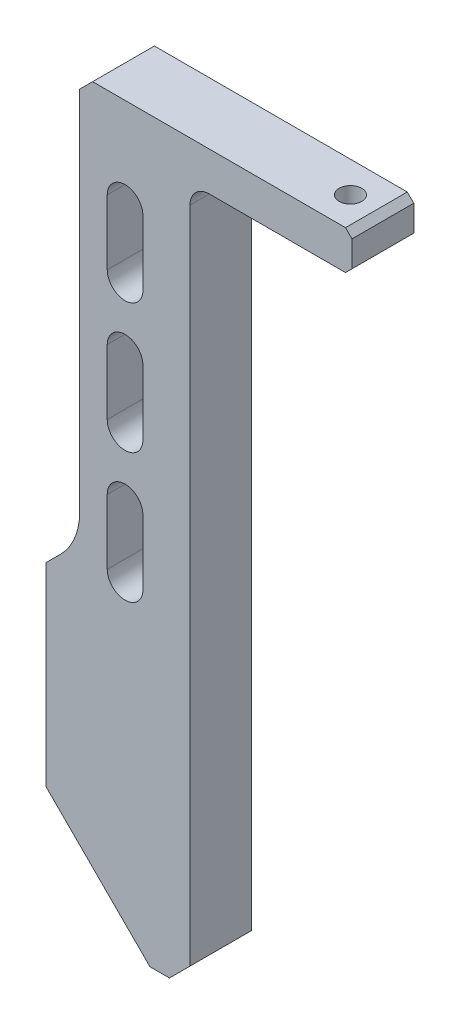
ISO-10303-21;
HEADER;
FILE_DESCRIPTION(('STEP AP214'),'2;1');
FILE_NAME('part.step','',(''),(''),'','','');
FILE_SCHEMA(('AUTOMOTIVE_DESIGN { 1 0 10303 214 1 1 1 1 }'));
ENDSEC;
DATA;
#1=APPLICATION_CONTEXT('core data for automotive mechanical design processes');
#2=APPLICATION_PROTOCOL_DEFINITION('international standard','automotive_design',2000,#1);
#3=PRODUCT_CONTEXT('',#1,'mechanical');
#4=PRODUCT('Part','Part','',(#3));
#5=PRODUCT_RELATED_PRODUCT_CATEGORY('part','',(#4));
#6=PRODUCT_DEFINITION_FORMATION('','',#4);
#7=PRODUCT_DEFINITION_CONTEXT('part definition',#1,'design');
#8=PRODUCT_DEFINITION('design','',#6,#7);
#9=PRODUCT_DEFINITION_SHAPE('','',#8);
#10=(LENGTH_UNIT() NAMED_UNIT(*) SI_UNIT(.MILLI.,.METRE.));
#11=(NAMED_UNIT(*) PLANE_ANGLE_UNIT() SI_UNIT($,.RADIAN.));
#12=(NAMED_UNIT(*) SI_UNIT($,.STERADIAN.) SOLID_ANGLE_UNIT());
#13=UNCERTAINTY_MEASURE_WITH_UNIT(LENGTH_MEASURE(1.E-05),#10,'distance_accuracy_value','');
#14=(GEOMETRIC_REPRESENTATION_CONTEXT(3) GLOBAL_UNCERTAINTY_ASSIGNED_CONTEXT((#13)) GLOBAL_UNIT_ASSIGNED_CONTEXT((#10,
#11,#12)) REPRESENTATION_CONTEXT('',''));
#15=CARTESIAN_POINT('',(0.,0.,0.));
#16=DIRECTION('',(0.,0.,1.));
#17=DIRECTION('',(1.,0.,0.));
#18=AXIS2_PLACEMENT_3D('',#15,#16,#17);
#19=CARTESIAN_POINT('',(-191.403805922284,11.3961940777128,-4.7625));
#20=DIRECTION('',(0.,-1.,0.));
#21=DIRECTION('',(0.,0.,-1.));
#22=AXIS2_PLACEMENT_3D('',#19,#20,#21);
#23=PLANE('',#22);
#24=DIRECTION('',(0.,0.,1.));
#25=VECTOR('',#24,1.);
#26=CARTESIAN_POINT('',(-188.403805922284,11.3961940777128,-4.7625));
#27=LINE('',#26,#25);
#28=CARTESIAN_POINT('',(-188.403805922284,11.3961940777128,-4.7625));
#29=VERTEX_POINT('',#28);
#30=CARTESIAN_POINT('',(-188.403805922284,11.3961940777128,4.7625));
#31=VERTEX_POINT('',#30);
#32=EDGE_CURVE('E368',#29,#31,#27,.T.);
#33=ORIENTED_EDGE('',*,*,#32,.T.);
#34=DIRECTION('',(1.,0.,0.));
#35=VECTOR('',#34,1.);
#36=CARTESIAN_POINT('',(-191.403805922284,11.3961940777128,4.7625));
#37=LINE('',#36,#35);
#38=CARTESIAN_POINT('',(-191.403805922284,11.3961940777128,4.7625));
#39=VERTEX_POINT('',#38);
#40=EDGE_CURVE('E265',#39,#31,#37,.T.);
#41=ORIENTED_EDGE('',*,*,#40,.F.);
#42=DIRECTION('',(0.,0.,1.));
#43=VECTOR('',#42,1.);
#44=CARTESIAN_POINT('',(-191.403805922284,11.3961940777128,-4.7625));
#45=LINE('',#44,#43);
#46=CARTESIAN_POINT('',(-191.403805922284,11.3961940777128,-4.7625));
#47=VERTEX_POINT('',#46);
#48=EDGE_CURVE('E369',#47,#39,#45,.T.);
#49=ORIENTED_EDGE('',*,*,#48,.F.);
#50=DIRECTION('',(1.,0.,0.));
#51=VECTOR('',#50,1.);
#52=CARTESIAN_POINT('',(-191.403805922284,11.3961940777128,-4.7625));
#53=LINE('',#52,#51);
#54=EDGE_CURVE('E337',#47,#29,#53,.T.);
#55=ORIENTED_EDGE('',*,*,#54,.T.);
#56=EDGE_LOOP('',(#33,#41,#49,#55));
#57=FACE_BOUND('',#56,.T.);
#58=ADVANCED_FACE('F31',(#57),#23,.T.);
#59=CARTESIAN_POINT('',(-191.403805922284,11.3961940777128,-4.7625));
#60=DIRECTION('',(-0.707106781186523,-0.707106781186572,0.));
#61=DIRECTION('',(0.707106781186572,-0.707106781186523,0.));
#62=AXIS2_PLACEMENT_3D('',#59,#60,#61);
#63=PLANE('',#62);
#64=ORIENTED_EDGE('',*,*,#48,.T.);
#65=DIRECTION('',(0.707106781186572,-0.707106781186523,0.));
#66=VECTOR('',#65,1.);
#67=CARTESIAN_POINT('',(-191.403805922284,11.3961940777128,4.7625));
#68=LINE('',#67,#66);
#69=CARTESIAN_POINT('',(-207.403805922285,27.3961940777123,4.7625));
#70=VERTEX_POINT('',#69);
#71=EDGE_CURVE('E287',#70,#39,#68,.T.);
#72=ORIENTED_EDGE('',*,*,#71,.F.);
#73=DIRECTION('',(0.,0.,1.));
#74=VECTOR('',#73,1.);
#75=CARTESIAN_POINT('',(-207.403805922285,27.3961940777123,-4.7625));
#76=LINE('',#75,#74);
#77=CARTESIAN_POINT('',(-207.403805922285,27.3961940777123,-4.7625));
#78=VERTEX_POINT('',#77);
#79=EDGE_CURVE('E372',#78,#70,#76,.T.);
#80=ORIENTED_EDGE('',*,*,#79,.F.);
#81=DIRECTION('',(0.707106781186572,-0.707106781186523,0.));
#82=VECTOR('',#81,1.);
#83=CARTESIAN_POINT('',(-191.403805922284,11.3961940777128,-4.7625));
#84=LINE('',#83,#82);
#85=EDGE_CURVE('E365',#78,#47,#84,.T.);
#86=ORIENTED_EDGE('',*,*,#85,.T.);
#87=EDGE_LOOP('',(#64,#72,#80,#86));
#88=FACE_BOUND('',#87,.T.);
#89=ADVANCED_FACE('F449',(#88),#63,.T.);
#90=CARTESIAN_POINT('',(-207.403805922285,27.3961940777123,-4.7625));
#91=DIRECTION('',(-1.,0.,0.));
#92=DIRECTION('',(0.,0.,1.));
#93=AXIS2_PLACEMENT_3D('',#90,#91,#92);
#94=PLANE('',#93);
#95=ORIENTED_EDGE('',*,*,#79,.T.);
#96=DIRECTION('',(0.,-1.,0.));
#97=VECTOR('',#96,1.);
#98=CARTESIAN_POINT('',(-207.403805922285,27.3961940777123,4.7625));
#99=LINE('',#98,#97);
#100=CARTESIAN_POINT('',(-207.403805922285,57.3961940777123,4.7625));
#101=VERTEX_POINT('',#100);
#102=EDGE_CURVE('E284',#101,#70,#99,.T.);
#103=ORIENTED_EDGE('',*,*,#102,.F.);
#104=DIRECTION('',(0.,0.,1.));
#105=VECTOR('',#104,1.);
#106=CARTESIAN_POINT('',(-207.403805922285,57.3961940777123,-4.7625));
#107=LINE('',#106,#105);
#108=CARTESIAN_POINT('',(-207.403805922285,57.3961940777123,-4.7625));
#109=VERTEX_POINT('',#108);
#110=EDGE_CURVE('E374',#109,#101,#107,.T.);
#111=ORIENTED_EDGE('',*,*,#110,.F.);
#112=DIRECTION('',(0.,-1.,0.));
#113=VECTOR('',#112,1.);
#114=CARTESIAN_POINT('',(-207.403805922285,27.3961940777123,-4.7625));
#115=LINE('',#114,#113);
#116=EDGE_CURVE('E362',#109,#78,#115,.T.);
#117=ORIENTED_EDGE('',*,*,#116,.T.);
#118=EDGE_LOOP('',(#95,#103,#111,#117));
#119=FACE_BOUND('',#118,.T.);
#120=ADVANCED_FACE('F455',(#119),#94,.T.);
#121=CARTESIAN_POINT('',(-202.247691321001,62.5523086789967,-4.7625));
#122=DIRECTION('',(-0.707106781186572,0.707106781186523,0.));
#123=DIRECTION('',(-0.707106781186523,-0.707106781186572,0.));
#124=AXIS2_PLACEMENT_3D('',#121,#122,#123);
#125=PLANE('',#124);
#126=DIRECTION('',(-0.707106781186523,-0.707106781186572,0.));
#127=VECTOR('',#126,1.);
#128=CARTESIAN_POINT('',(-202.247691321001,62.5523086789967,4.7625));
#129=LINE('',#128,#127);
#130=CARTESIAN_POINT('',(-205.176623509135,59.6233764908622,4.7625));
#131=VERTEX_POINT('',#130);
#132=EDGE_CURVE('E282',#131,#101,#129,.T.);
#133=ORIENTED_EDGE('',*,*,#132,.F.);
#134=DIRECTION('',(0.,0.,1.));
#135=VECTOR('',#134,1.);
#136=CARTESIAN_POINT('',(-205.176623509135,59.6233764908622,-4.7625));
#137=LINE('',#136,#135);
#138=CARTESIAN_POINT('',(-205.176623509135,59.6233764908622,-4.7625));
#139=VERTEX_POINT('',#138);
#140=EDGE_CURVE('E385',#131,#139,#137,.F.);
#141=ORIENTED_EDGE('',*,*,#140,.T.);
#142=DIRECTION('',(-0.707106781186523,-0.707106781186572,0.));
#143=VECTOR('',#142,1.);
#144=CARTESIAN_POINT('',(-202.247691321001,62.5523086789967,-4.7625));
#145=LINE('',#144,#143);
#146=EDGE_CURVE('E360',#139,#109,#145,.T.);
#147=ORIENTED_EDGE('',*,*,#146,.T.);
#148=ORIENTED_EDGE('',*,*,#110,.T.);
#149=EDGE_LOOP('',(#133,#141,#147,#148));
#150=FACE_BOUND('',#149,.T.);
#151=ADVANCED_FACE('F503',(#150),#125,.T.);
#152=CARTESIAN_POINT('',(-202.247691321001,125.192388155427,-4.7625));
#153=DIRECTION('',(-1.,0.,0.));
#154=DIRECTION('',(0.,0.,1.));
#155=AXIS2_PLACEMENT_3D('',#152,#153,#154);
#156=PLANE('',#155);
#157=DIRECTION('',(0.,-1.,0.));
#158=VECTOR('',#157,1.);
#159=CARTESIAN_POINT('',(-202.247691321001,125.192388155427,4.7625));
#160=LINE('',#159,#158);
#161=CARTESIAN_POINT('',(-202.247691321001,123.192388155427,4.7625));
#162=VERTEX_POINT('',#161);
#163=CARTESIAN_POINT('',(-202.247691321001,66.6944443027275,4.7625));
#164=VERTEX_POINT('',#163);
#165=EDGE_CURVE('E280',#162,#164,#160,.T.);
#166=ORIENTED_EDGE('',*,*,#165,.F.);
#167=DIRECTION('',(0.,0.,-1.));
#168=VECTOR('',#167,1.);
#169=CARTESIAN_POINT('',(-202.247691321001,123.192388155427,-4.7625));
#170=LINE('',#169,#168);
#171=CARTESIAN_POINT('',(-202.247691321001,123.192388155427,-4.7625));
#172=VERTEX_POINT('',#171);
#173=EDGE_CURVE('E397',#162,#172,#170,.T.);
#174=ORIENTED_EDGE('',*,*,#173,.T.);
#175=DIRECTION('',(0.,-1.,0.));
#176=VECTOR('',#175,1.);
#177=CARTESIAN_POINT('',(-202.247691321001,125.192388155427,-4.7625));
#178=LINE('',#177,#176);
#179=CARTESIAN_POINT('',(-202.247691321001,66.6944443027275,-4.7625));
#180=VERTEX_POINT('',#179);
#181=EDGE_CURVE('E358',#172,#180,#178,.T.);
#182=ORIENTED_EDGE('',*,*,#181,.T.);
#183=DIRECTION('',(0.,0.,1.));
#184=VECTOR('',#183,1.);
#185=CARTESIAN_POINT('',(-202.247691321001,66.6944443027275,4.7625));
#186=LINE('',#185,#184);
#187=EDGE_CURVE('E371',#180,#164,#186,.T.);
#188=ORIENTED_EDGE('',*,*,#187,.T.);
#189=EDGE_LOOP('',(#166,#174,#182,#188));
#190=FACE_BOUND('',#189,.T.);
#191=ADVANCED_FACE('F496',(#190),#156,.T.);
#192=CARTESIAN_POINT('',(-160.247691321001,125.192388155427,-4.7625));
#193=DIRECTION('',(0.,1.,0.));
#194=DIRECTION('',(0.,0.,1.));
#195=AXIS2_PLACEMENT_3D('',#192,#193,#194);
#196=PLANE('',#195);
#197=CARTESIAN_POINT('',(-165.247691321001,125.192388155427,0.));
#198=DIRECTION('',(0.,1.,0.));
#199=DIRECTION('',(-1.,0.,0.));
#200=AXIS2_PLACEMENT_3D('',#197,#198,#199);
#201=CIRCLE('',#200,1.75000000000001);
#202=CARTESIAN_POINT('',(-166.997691321001,125.192388155427,0.));
#203=VERTEX_POINT('',#202);
#204=EDGE_CURVE('E382',#203,#203,#201,.T.);
#205=ORIENTED_EDGE('',*,*,#204,.F.);
#206=EDGE_LOOP('',(#205));
#207=FACE_BOUND('',#206,.T.);
#208=DIRECTION('',(-1.,0.,0.));
#209=VECTOR('',#208,1.);
#210=CARTESIAN_POINT('',(-160.247691321001,125.192388155427,4.7625));
#211=LINE('',#210,#209);
#212=CARTESIAN_POINT('',(-161.247691321001,125.192388155427,4.7625));
#213=VERTEX_POINT('',#212);
#214=CARTESIAN_POINT('',(-200.247691321001,125.192388155427,4.7625));
#215=VERTEX_POINT('',#214);
#216=EDGE_CURVE('E278',#213,#215,#211,.T.);
#217=ORIENTED_EDGE('',*,*,#216,.F.);
#218=DIRECTION('',(0.,0.,-1.));
#219=VECTOR('',#218,1.);
#220=CARTESIAN_POINT('',(-161.247691321001,125.192388155427,-4.7625));
#221=LINE('',#220,#219);
#222=CARTESIAN_POINT('',(-161.247691321001,125.192388155427,-4.7625));
#223=VERTEX_POINT('',#222);
#224=EDGE_CURVE('E411',#213,#223,#221,.T.);
#225=ORIENTED_EDGE('',*,*,#224,.T.);
#226=DIRECTION('',(-1.,0.,0.));
#227=VECTOR('',#226,1.);
#228=CARTESIAN_POINT('',(-160.247691321001,125.192388155427,-4.7625));
#229=LINE('',#228,#227);
#230=CARTESIAN_POINT('',(-200.247691321001,125.192388155427,-4.7625));
#231=VERTEX_POINT('',#230);
#232=EDGE_CURVE('E356',#223,#231,#229,.T.);
#233=ORIENTED_EDGE('',*,*,#232,.T.);
#234=DIRECTION('',(0.,0.,1.));
#235=VECTOR('',#234,1.);
#236=CARTESIAN_POINT('',(-200.247691321001,125.192388155427,-4.7625));
#237=LINE('',#236,#235);
#238=EDGE_CURVE('E392',#231,#215,#237,.T.);
#239=ORIENTED_EDGE('',*,*,#238,.T.);
#240=EDGE_LOOP('',(#217,#225,#233,#239));
#241=FACE_BOUND('',#240,.T.);
#242=ADVANCED_FACE('F489',(#207,#241),#196,.T.);
#243=CARTESIAN_POINT('',(-160.247691321001,119.192388155427,-4.7625));
#244=DIRECTION('',(1.,0.,0.));
#245=DIRECTION('',(0.,0.,-1.));
#246=AXIS2_PLACEMENT_3D('',#243,#244,#245);
#247=PLANE('',#246);
#248=DIRECTION('',(0.,1.,0.));
#249=VECTOR('',#248,1.);
#250=CARTESIAN_POINT('',(-160.247691321001,119.192388155427,-4.7625));
#251=LINE('',#250,#249);
#252=CARTESIAN_POINT('',(-160.247691321001,120.192388155427,-4.7625));
#253=VERTEX_POINT('',#252);
#254=CARTESIAN_POINT('',(-160.247691321001,124.192388155427,-4.7625));
#255=VERTEX_POINT('',#254);
#256=EDGE_CURVE('E353',#253,#255,#251,.T.);
#257=ORIENTED_EDGE('',*,*,#256,.T.);
#258=DIRECTION('',(0.,0.,1.));
#259=VECTOR('',#258,1.);
#260=CARTESIAN_POINT('',(-160.247691321001,124.192388155427,-4.7625));
#261=LINE('',#260,#259);
#262=CARTESIAN_POINT('',(-160.247691321001,124.192388155427,4.7625));
#263=VERTEX_POINT('',#262);
#264=EDGE_CURVE('E404',#255,#263,#261,.T.);
#265=ORIENTED_EDGE('',*,*,#264,.T.);
#266=DIRECTION('',(0.,1.,0.));
#267=VECTOR('',#266,1.);
#268=CARTESIAN_POINT('',(-160.247691321001,119.192388155427,4.7625));
#269=LINE('',#268,#267);
#270=CARTESIAN_POINT('',(-160.247691321001,120.192388155427,4.7625));
#271=VERTEX_POINT('',#270);
#272=EDGE_CURVE('E275',#271,#263,#269,.T.);
#273=ORIENTED_EDGE('',*,*,#272,.F.);
#274=DIRECTION('',(0.,0.,-1.));
#275=VECTOR('',#274,1.);
#276=CARTESIAN_POINT('',(-160.247691321001,120.192388155427,-4.7625));
#277=LINE('',#276,#275);
#278=EDGE_CURVE('E402',#271,#253,#277,.T.);
#279=ORIENTED_EDGE('',*,*,#278,.T.);
#280=EDGE_LOOP('',(#257,#265,#273,#279));
#281=FACE_BOUND('',#280,.T.);
#282=ADVANCED_FACE('F480',(#281),#247,.T.);
#283=CARTESIAN_POINT('',(-185.247691321001,119.192388155427,-4.7625));
#284=DIRECTION('',(0.,-1.,0.));
#285=DIRECTION('',(0.,0.,-1.));
#286=AXIS2_PLACEMENT_3D('',#283,#284,#285);
#287=PLANE('',#286);
#288=CARTESIAN_POINT('',(-165.247691321001,119.192388155427,0.));
#289=DIRECTION('',(0.,-1.,0.));
#290=DIRECTION('',(0.,0.,-1.));
#291=AXIS2_PLACEMENT_3D('',#288,#289,#290);
#292=CIRCLE('',#291,1.75000000000001);
#293=CARTESIAN_POINT('',(-165.247691321001,119.192388155427,-1.75000000000001));
#294=VERTEX_POINT('',#293);
#295=EDGE_CURVE('E230',#294,#294,#292,.T.);
#296=ORIENTED_EDGE('',*,*,#295,.F.);
#297=EDGE_LOOP('',(#296));
#298=FACE_BOUND('',#297,.T.);
#299=DIRECTION('',(1.,0.,0.));
#300=VECTOR('',#299,1.);
#301=CARTESIAN_POINT('',(-185.247691321001,119.192388155427,4.7625));
#302=LINE('',#301,#300);
#303=CARTESIAN_POINT('',(-182.247691321001,119.192388155427,4.7625));
#304=VERTEX_POINT('',#303);
#305=CARTESIAN_POINT('',(-161.247691321001,119.192388155427,4.7625));
#306=VERTEX_POINT('',#305);
#307=EDGE_CURVE('E273',#304,#306,#302,.T.);
#308=ORIENTED_EDGE('',*,*,#307,.F.);
#309=DIRECTION('',(0.,0.,1.));
#310=VECTOR('',#309,1.);
#311=CARTESIAN_POINT('',(-182.247691321001,119.192388155427,-4.7625));
#312=LINE('',#311,#310);
#313=CARTESIAN_POINT('',(-182.247691321001,119.192388155427,-4.7625));
#314=VERTEX_POINT('',#313);
#315=EDGE_CURVE('E52',#304,#314,#312,.F.);
#316=ORIENTED_EDGE('',*,*,#315,.T.);
#317=DIRECTION('',(1.,0.,0.));
#318=VECTOR('',#317,1.);
#319=CARTESIAN_POINT('',(-185.247691321001,119.192388155427,-4.7625));
#320=LINE('',#319,#318);
#321=CARTESIAN_POINT('',(-161.247691321001,119.192388155427,-4.7625));
#322=VERTEX_POINT('',#321);
#323=EDGE_CURVE('E351',#314,#322,#320,.T.);
#324=ORIENTED_EDGE('',*,*,#323,.T.);
#325=DIRECTION('',(0.,0.,1.));
#326=VECTOR('',#325,1.);
#327=CARTESIAN_POINT('',(-161.247691321001,119.192388155427,-4.7625));
#328=LINE('',#327,#326);
#329=EDGE_CURVE('E418',#322,#306,#328,.T.);
#330=ORIENTED_EDGE('',*,*,#329,.T.);
#331=EDGE_LOOP('',(#308,#316,#324,#330));
#332=FACE_BOUND('',#331,.T.);
#333=ADVANCED_FACE('F485',(#298,#332),#287,.T.);
#334=CARTESIAN_POINT('',(-185.247691321001,119.192388155427,-4.7625));
#335=DIRECTION('',(1.,0.,0.));
#336=DIRECTION('',(0.,1.,0.));
#337=AXIS2_PLACEMENT_3D('',#334,#335,#336);
#338=PLANE('',#337);
#339=DIRECTION('',(0.,1.,0.));
#340=VECTOR('',#339,1.);
#341=CARTESIAN_POINT('',(-185.247691321001,119.192388155427,-4.7625));
#342=LINE('',#341,#340);
#343=CARTESIAN_POINT('',(-185.247691321001,14.5523086789966,-4.7625));
#344=VERTEX_POINT('',#343);
#345=CARTESIAN_POINT('',(-185.247691321001,116.192388155427,-4.7625));
#346=VERTEX_POINT('',#345);
#347=EDGE_CURVE('E348',#344,#346,#342,.T.);
#348=ORIENTED_EDGE('',*,*,#347,.T.);
#349=DIRECTION('',(0.,0.,1.));
#350=VECTOR('',#349,1.);
#351=CARTESIAN_POINT('',(-185.247691321001,116.192388155427,4.7625));
#352=LINE('',#351,#350);
#353=CARTESIAN_POINT('',(-185.247691321001,116.192388155427,4.7625));
#354=VERTEX_POINT('',#353);
#355=EDGE_CURVE('E421',#346,#354,#352,.T.);
#356=ORIENTED_EDGE('',*,*,#355,.T.);
#357=DIRECTION('',(0.,1.,0.));
#358=VECTOR('',#357,1.);
#359=CARTESIAN_POINT('',(-185.247691321001,119.192388155427,4.7625));
#360=LINE('',#359,#358);
#361=CARTESIAN_POINT('',(-185.247691321001,14.5523086789966,4.7625));
#362=VERTEX_POINT('',#361);
#363=EDGE_CURVE('E271',#362,#354,#360,.T.);
#364=ORIENTED_EDGE('',*,*,#363,.F.);
#365=DIRECTION('',(0.,0.,1.));
#366=VECTOR('',#365,1.);
#367=CARTESIAN_POINT('',(-185.247691321001,14.5523086789966,-4.7625));
#368=LINE('',#367,#366);
#369=EDGE_CURVE('E377',#344,#362,#368,.T.);
#370=ORIENTED_EDGE('',*,*,#369,.F.);
#371=EDGE_LOOP('',(#348,#356,#364,#370));
#372=FACE_BOUND('',#371,.T.);
#373=ADVANCED_FACE('F427',(#372),#338,.T.);
#374=CARTESIAN_POINT('',(-185.247691321001,14.5523086789966,-4.7625));
#375=DIRECTION('',(0.707106781186574,-0.707106781186522,0.));
#376=DIRECTION('',(0.707106781186522,0.707106781186573,0.));
#377=AXIS2_PLACEMENT_3D('',#374,#375,#376);
#378=PLANE('',#377);
#379=ORIENTED_EDGE('',*,*,#369,.T.);
#380=DIRECTION('',(0.707106781186522,0.707106781186573,0.));
#381=VECTOR('',#380,1.);
#382=CARTESIAN_POINT('',(-185.247691321001,14.5523086789966,4.7625));
#383=LINE('',#382,#381);
#384=EDGE_CURVE('E268',#31,#362,#383,.T.);
#385=ORIENTED_EDGE('',*,*,#384,.F.);
#386=ORIENTED_EDGE('',*,*,#32,.F.);
#387=DIRECTION('',(0.707106781186522,0.707106781186573,0.));
#388=VECTOR('',#387,1.);
#389=CARTESIAN_POINT('',(-185.247691321001,14.5523086789966,-4.7625));
#390=LINE('',#389,#388);
#391=EDGE_CURVE('E345',#29,#344,#390,.T.);
#392=ORIENTED_EDGE('',*,*,#391,.T.);
#393=EDGE_LOOP('',(#379,#385,#386,#392));
#394=FACE_BOUND('',#393,.T.);
#395=ADVANCED_FACE('F435',(#394),#378,.T.);
#396=CARTESIAN_POINT('',(-185.247691321001,11.3961940777128,-4.7625));
#397=DIRECTION('',(0.,0.,-1.));
#398=DIRECTION('',(-1.,0.,0.));
#399=AXIS2_PLACEMENT_3D('',#396,#397,#398);
#400=PLANE('',#399);
#401=CARTESIAN_POINT('',(-195.247691321001,101.192388155427,-4.7625));
#402=DIRECTION('',(0.,0.,1.));
#403=DIRECTION('',(1.,0.,0.));
#404=AXIS2_PLACEMENT_3D('',#401,#402,#403);
#405=CIRCLE('',#404,2.75);
#406=CARTESIAN_POINT('',(-197.997691321001,101.192388155427,-4.7625));
#407=VERTEX_POINT('',#406);
#408=CARTESIAN_POINT('',(-192.497691321001,101.192388155427,-4.7625));
#409=VERTEX_POINT('',#408);
#410=EDGE_CURVE('E290',#407,#409,#405,.T.);
#411=ORIENTED_EDGE('',*,*,#410,.T.);
#412=DIRECTION('',(0.,1.,0.));
#413=VECTOR('',#412,1.);
#414=CARTESIAN_POINT('',(-192.497691321001,101.192388155427,-4.7625));
#415=LINE('',#414,#413);
#416=CARTESIAN_POINT('',(-192.497691321001,111.192388155427,-4.7625));
#417=VERTEX_POINT('',#416);
#418=EDGE_CURVE('E216',#409,#417,#415,.T.);
#419=ORIENTED_EDGE('',*,*,#418,.T.);
#420=CARTESIAN_POINT('',(-195.247691321001,111.192388155427,-4.7625));
#421=DIRECTION('',(0.,0.,1.));
#422=DIRECTION('',(1.,0.,0.));
#423=AXIS2_PLACEMENT_3D('',#420,#421,#422);
#424=CIRCLE('',#423,2.75);
#425=CARTESIAN_POINT('',(-197.997691321001,111.192388155427,-4.7625));
#426=VERTEX_POINT('',#425);
#427=EDGE_CURVE('E293',#417,#426,#424,.T.);
#428=ORIENTED_EDGE('',*,*,#427,.T.);
#429=DIRECTION('',(0.,-1.,0.));
#430=VECTOR('',#429,1.);
#431=CARTESIAN_POINT('',(-197.997691321001,101.192388155427,-4.7625));
#432=LINE('',#431,#430);
#433=EDGE_CURVE('E221',#426,#407,#432,.T.);
#434=ORIENTED_EDGE('',*,*,#433,.T.);
#435=EDGE_LOOP('',(#411,#419,#428,#434));
#436=FACE_BOUND('',#435,.T.);
#437=CARTESIAN_POINT('',(-195.247691321001,81.1923881554272,-4.7625));
#438=DIRECTION('',(0.,0.,1.));
#439=DIRECTION('',(1.,0.,0.));
#440=AXIS2_PLACEMENT_3D('',#437,#438,#439);
#441=CIRCLE('',#440,2.75);
#442=CARTESIAN_POINT('',(-197.997691321001,81.1923881554272,-4.7625));
#443=VERTEX_POINT('',#442);
#444=CARTESIAN_POINT('',(-192.497691321001,81.1923881554272,-4.7625));
#445=VERTEX_POINT('',#444);
#446=EDGE_CURVE('E299',#443,#445,#441,.T.);
#447=ORIENTED_EDGE('',*,*,#446,.T.);
#448=DIRECTION('',(0.,1.,0.));
#449=VECTOR('',#448,1.);
#450=CARTESIAN_POINT('',(-192.497691321001,81.1923881554272,-4.7625));
#451=LINE('',#450,#449);
#452=CARTESIAN_POINT('',(-192.497691321001,91.1923881554272,-4.7625));
#453=VERTEX_POINT('',#452);
#454=EDGE_CURVE('E305',#445,#453,#451,.T.);
#455=ORIENTED_EDGE('',*,*,#454,.T.);
#456=CARTESIAN_POINT('',(-195.247691321001,91.1923881554272,-4.7625));
#457=DIRECTION('',(0.,0.,1.));
#458=DIRECTION('',(1.,0.,0.));
#459=AXIS2_PLACEMENT_3D('',#456,#457,#458);
#460=CIRCLE('',#459,2.75);
#461=CARTESIAN_POINT('',(-197.997691321001,91.1923881554272,-4.7625));
#462=VERTEX_POINT('',#461);
#463=EDGE_CURVE('E308',#453,#462,#460,.T.);
#464=ORIENTED_EDGE('',*,*,#463,.T.);
#465=DIRECTION('',(0.,-1.,0.));
#466=VECTOR('',#465,1.);
#467=CARTESIAN_POINT('',(-197.997691321001,81.1923881554272,-4.7625));
#468=LINE('',#467,#466);
#469=EDGE_CURVE('E311',#462,#443,#468,.T.);
#470=ORIENTED_EDGE('',*,*,#469,.T.);
#471=EDGE_LOOP('',(#447,#455,#464,#470));
#472=FACE_BOUND('',#471,.T.);
#473=CARTESIAN_POINT('',(-195.247691321001,61.1923881554272,-4.7625));
#474=DIRECTION('',(0.,0.,1.));
#475=DIRECTION('',(1.,0.,0.));
#476=AXIS2_PLACEMENT_3D('',#473,#474,#475);
#477=CIRCLE('',#476,2.75);
#478=CARTESIAN_POINT('',(-197.997691321001,61.1923881554272,-4.7625));
#479=VERTEX_POINT('',#478);
#480=CARTESIAN_POINT('',(-192.497691321001,61.1923881554272,-4.7625));
#481=VERTEX_POINT('',#480);
#482=EDGE_CURVE('E317',#479,#481,#477,.T.);
#483=ORIENTED_EDGE('',*,*,#482,.T.);
#484=DIRECTION('',(0.,1.,0.));
#485=VECTOR('',#484,1.);
#486=CARTESIAN_POINT('',(-192.497691321001,61.1923881554272,-4.7625));
#487=LINE('',#486,#485);
#488=CARTESIAN_POINT('',(-192.497691321001,71.1923881554272,-4.7625));
#489=VERTEX_POINT('',#488);
#490=EDGE_CURVE('E325',#481,#489,#487,.T.);
#491=ORIENTED_EDGE('',*,*,#490,.T.);
#492=CARTESIAN_POINT('',(-195.247691321001,71.1923881554272,-4.7625));
#493=DIRECTION('',(0.,0.,1.));
#494=DIRECTION('',(1.,0.,0.));
#495=AXIS2_PLACEMENT_3D('',#492,#493,#494);
#496=CIRCLE('',#495,2.75000000000003);
#497=CARTESIAN_POINT('',(-197.997691321001,71.1923881554272,-4.7625));
#498=VERTEX_POINT('',#497);
#499=EDGE_CURVE('E328',#489,#498,#496,.T.);
#500=ORIENTED_EDGE('',*,*,#499,.T.);
#501=DIRECTION('',(0.,-1.,0.));
#502=VECTOR('',#501,1.);
#503=CARTESIAN_POINT('',(-197.997691321001,61.1923881554272,-4.7625));
#504=LINE('',#503,#502);
#505=EDGE_CURVE('E331',#498,#479,#504,.T.);
#506=ORIENTED_EDGE('',*,*,#505,.T.);
#507=EDGE_LOOP('',(#483,#491,#500,#506));
#508=FACE_BOUND('',#507,.T.);
#509=ORIENTED_EDGE('',*,*,#232,.F.);
#510=DIRECTION('',(-0.707106781186548,0.707106781186548,0.));
#511=VECTOR('',#510,1.);
#512=CARTESIAN_POINT('',(-116.349594282144,80.29429111657,-4.7625));
#513=LINE('',#512,#511);
#514=EDGE_CURVE('E416',#223,#255,#513,.F.);
#515=ORIENTED_EDGE('',*,*,#514,.T.);
#516=ORIENTED_EDGE('',*,*,#256,.F.);
#517=DIRECTION('',(0.707106781186552,0.707106781186543,0.));
#518=VECTOR('',#517,1.);
#519=CARTESIAN_POINT('',(-227.145788359858,53.2942911165708,-4.7625));
#520=LINE('',#519,#518);
#521=EDGE_CURVE('E413',#253,#322,#520,.F.);
#522=ORIENTED_EDGE('',*,*,#521,.T.);
#523=ORIENTED_EDGE('',*,*,#323,.F.);
#524=CARTESIAN_POINT('',(-182.247691321001,116.192388155427,-4.7625));
#525=DIRECTION('',(0.,0.,-1.));
#526=DIRECTION('',(-1.,0.,0.));
#527=AXIS2_PLACEMENT_3D('',#524,#525,#526);
#528=CIRCLE('',#527,3.);
#529=EDGE_CURVE('E11',#314,#346,#528,.F.);
#530=ORIENTED_EDGE('',*,*,#529,.T.);
#531=ORIENTED_EDGE('',*,*,#347,.F.);
#532=ORIENTED_EDGE('',*,*,#391,.F.);
#533=ORIENTED_EDGE('',*,*,#54,.F.);
#534=ORIENTED_EDGE('',*,*,#85,.F.);
#535=ORIENTED_EDGE('',*,*,#116,.F.);
#536=ORIENTED_EDGE('',*,*,#146,.F.);
#537=CARTESIAN_POINT('',(-212.247691321001,66.6944443027275,-4.7625));
#538=DIRECTION('',(0.,0.,-1.));
#539=DIRECTION('',(-1.,0.,0.));
#540=AXIS2_PLACEMENT_3D('',#537,#538,#539);
#541=CIRCLE('',#540,10.);
#542=EDGE_CURVE('E389',#139,#180,#541,.F.);
#543=ORIENTED_EDGE('',*,*,#542,.T.);
#544=ORIENTED_EDGE('',*,*,#181,.F.);
#545=DIRECTION('',(-0.707106781186545,-0.70710678118655,0.));
#546=VECTOR('',#545,1.);
#547=CARTESIAN_POINT('',(-249.645788359858,75.7942911165696,-4.7625));
#548=LINE('',#547,#546);
#549=EDGE_CURVE('E399',#172,#231,#548,.F.);
#550=ORIENTED_EDGE('',*,*,#549,.T.);
#551=EDGE_LOOP('',(#509,#515,#516,#522,#523,#530,#531,#532,#533,#534,#535,#536,#543,#544,#550));
#552=FACE_BOUND('',#551,.T.);
#553=ADVANCED_FACE('F439',(#436,#472,#508,#552),#400,.T.);
#554=CARTESIAN_POINT('',(-195.247691321001,61.1923881554272,-4.7625));
#555=DIRECTION('',(0.,0.,1.));
#556=DIRECTION('',(1.,0.,0.));
#557=AXIS2_PLACEMENT_3D('',#554,#555,#556);
#558=CYLINDRICAL_SURFACE('',#557,2.75);
#559=DIRECTION('',(0.,0.,1.));
#560=VECTOR('',#559,1.);
#561=CARTESIAN_POINT('',(-197.997691321001,61.1923881554272,-4.7625));
#562=LINE('',#561,#560);
#563=CARTESIAN_POINT('',(-197.997691321001,61.1923881554272,4.7625));
#564=VERTEX_POINT('',#563);
#565=EDGE_CURVE('E335',#479,#564,#562,.T.);
#566=ORIENTED_EDGE('',*,*,#565,.T.);
#567=CARTESIAN_POINT('',(-195.247691321001,61.1923881554272,4.7625));
#568=DIRECTION('',(0.,0.,1.));
#569=DIRECTION('',(1.,0.,0.));
#570=AXIS2_PLACEMENT_3D('',#567,#568,#569);
#571=CIRCLE('',#570,2.75);
#572=CARTESIAN_POINT('',(-192.497691321001,61.1923881554272,4.7625));
#573=VERTEX_POINT('',#572);
#574=EDGE_CURVE('E253',#564,#573,#571,.T.);
#575=ORIENTED_EDGE('',*,*,#574,.T.);
#576=DIRECTION('',(0.,0.,1.));
#577=VECTOR('',#576,1.);
#578=CARTESIAN_POINT('',(-192.497691321001,61.1923881554272,-4.7625));
#579=LINE('',#578,#577);
#580=EDGE_CURVE('E334',#481,#573,#579,.T.);
#581=ORIENTED_EDGE('',*,*,#580,.F.);
#582=ORIENTED_EDGE('',*,*,#482,.F.);
#583=EDGE_LOOP('',(#566,#575,#581,#582));
#584=FACE_BOUND('',#583,.T.);
#585=ADVANCED_FACE('F536',(#584),#558,.F.);
#586=CARTESIAN_POINT('',(-197.997691321001,61.1923881554272,-4.7625));
#587=DIRECTION('',(-1.,0.,0.));
#588=DIRECTION('',(0.,-1.,0.));
#589=AXIS2_PLACEMENT_3D('',#586,#587,#588);
#590=PLANE('',#589);
#591=DIRECTION('',(0.,0.,1.));
#592=VECTOR('',#591,1.);
#593=CARTESIAN_POINT('',(-197.997691321001,71.1923881554272,-4.7625));
#594=LINE('',#593,#592);
#595=CARTESIAN_POINT('',(-197.997691321001,71.1923881554272,4.7625));
#596=VERTEX_POINT('',#595);
#597=EDGE_CURVE('E338',#498,#596,#594,.T.);
#598=ORIENTED_EDGE('',*,*,#597,.T.);
#599=DIRECTION('',(0.,-1.,0.));
#600=VECTOR('',#599,1.);
#601=CARTESIAN_POINT('',(-197.997691321001,61.1923881554272,4.7625));
#602=LINE('',#601,#600);
#603=EDGE_CURVE('E262',#596,#564,#602,.T.);
#604=ORIENTED_EDGE('',*,*,#603,.T.);
#605=ORIENTED_EDGE('',*,*,#565,.F.);
#606=ORIENTED_EDGE('',*,*,#505,.F.);
#607=EDGE_LOOP('',(#598,#604,#605,#606));
#608=FACE_BOUND('',#607,.T.);
#609=ADVANCED_FACE('F541',(#608),#590,.F.);
#610=CARTESIAN_POINT('',(-195.247691321001,71.1923881554272,-4.7625));
#611=DIRECTION('',(0.,0.,1.));
#612=DIRECTION('',(1.,0.,0.));
#613=AXIS2_PLACEMENT_3D('',#610,#611,#612);
#614=CYLINDRICAL_SURFACE('',#613,2.75000000000003);
#615=DIRECTION('',(0.,0.,1.));
#616=VECTOR('',#615,1.);
#617=CARTESIAN_POINT('',(-192.497691321001,71.1923881554272,-4.7625));
#618=LINE('',#617,#616);
#619=CARTESIAN_POINT('',(-192.497691321001,71.1923881554272,4.7625));
#620=VERTEX_POINT('',#619);
#621=EDGE_CURVE('E340',#489,#620,#618,.T.);
#622=ORIENTED_EDGE('',*,*,#621,.T.);
#623=CARTESIAN_POINT('',(-195.247691321001,71.1923881554272,4.7625));
#624=DIRECTION('',(0.,0.,1.));
#625=DIRECTION('',(1.,0.,0.));
#626=AXIS2_PLACEMENT_3D('',#623,#624,#625);
#627=CIRCLE('',#626,2.75000000000003);
#628=EDGE_CURVE('E259',#620,#596,#627,.T.);
#629=ORIENTED_EDGE('',*,*,#628,.T.);
#630=ORIENTED_EDGE('',*,*,#597,.F.);
#631=ORIENTED_EDGE('',*,*,#499,.F.);
#632=EDGE_LOOP('',(#622,#629,#630,#631));
#633=FACE_BOUND('',#632,.T.);
#634=ADVANCED_FACE('F550',(#633),#614,.F.);
#635=CARTESIAN_POINT('',(-192.497691321001,61.1923881554272,-4.7625));
#636=DIRECTION('',(1.,0.,0.));
#637=DIRECTION('',(0.,1.,0.));
#638=AXIS2_PLACEMENT_3D('',#635,#636,#637);
#639=PLANE('',#638);
#640=ORIENTED_EDGE('',*,*,#580,.T.);
#641=DIRECTION('',(0.,1.,0.));
#642=VECTOR('',#641,1.);
#643=CARTESIAN_POINT('',(-192.497691321001,61.1923881554272,4.7625));
#644=LINE('',#643,#642);
#645=EDGE_CURVE('E256',#573,#620,#644,.T.);
#646=ORIENTED_EDGE('',*,*,#645,.T.);
#647=ORIENTED_EDGE('',*,*,#621,.F.);
#648=ORIENTED_EDGE('',*,*,#490,.F.);
#649=EDGE_LOOP('',(#640,#646,#647,#648));
#650=FACE_BOUND('',#649,.T.);
#651=ADVANCED_FACE('F546',(#650),#639,.F.);
#652=CARTESIAN_POINT('',(-195.247691321001,81.1923881554272,-4.7625));
#653=DIRECTION('',(0.,0.,1.));
#654=DIRECTION('',(1.,0.,0.));
#655=AXIS2_PLACEMENT_3D('',#652,#653,#654);
#656=CYLINDRICAL_SURFACE('',#655,2.75);
#657=DIRECTION('',(0.,0.,1.));
#658=VECTOR('',#657,1.);
#659=CARTESIAN_POINT('',(-197.997691321001,81.1923881554272,-4.7625));
#660=LINE('',#659,#658);
#661=CARTESIAN_POINT('',(-197.997691321001,81.1923881554272,4.7625));
#662=VERTEX_POINT('',#661);
#663=EDGE_CURVE('E315',#443,#662,#660,.T.);
#664=ORIENTED_EDGE('',*,*,#663,.T.);
#665=CARTESIAN_POINT('',(-195.247691321001,81.1923881554272,4.7625));
#666=DIRECTION('',(0.,0.,1.));
#667=DIRECTION('',(1.,0.,0.));
#668=AXIS2_PLACEMENT_3D('',#665,#666,#667);
#669=CIRCLE('',#668,2.75);
#670=CARTESIAN_POINT('',(-192.497691321001,81.1923881554272,4.7625));
#671=VERTEX_POINT('',#670);
#672=EDGE_CURVE('E241',#662,#671,#669,.T.);
#673=ORIENTED_EDGE('',*,*,#672,.T.);
#674=DIRECTION('',(0.,0.,1.));
#675=VECTOR('',#674,1.);
#676=CARTESIAN_POINT('',(-192.497691321001,81.1923881554272,-4.7625));
#677=LINE('',#676,#675);
#678=EDGE_CURVE('E314',#445,#671,#677,.T.);
#679=ORIENTED_EDGE('',*,*,#678,.F.);
#680=ORIENTED_EDGE('',*,*,#446,.F.);
#681=EDGE_LOOP('',(#664,#673,#679,#680));
#682=FACE_BOUND('',#681,.T.);
#683=ADVANCED_FACE('F549',(#682),#656,.F.);
#684=CARTESIAN_POINT('',(-197.997691321001,81.1923881554272,-4.7625));
#685=DIRECTION('',(-1.,0.,0.));
#686=DIRECTION('',(0.,0.,1.));
#687=AXIS2_PLACEMENT_3D('',#684,#685,#686);
#688=PLANE('',#687);
#689=DIRECTION('',(0.,0.,1.));
#690=VECTOR('',#689,1.);
#691=CARTESIAN_POINT('',(-197.997691321001,91.1923881554272,-4.7625));
#692=LINE('',#691,#690);
#693=CARTESIAN_POINT('',(-197.997691321001,91.1923881554272,4.7625));
#694=VERTEX_POINT('',#693);
#695=EDGE_CURVE('E318',#462,#694,#692,.T.);
#696=ORIENTED_EDGE('',*,*,#695,.T.);
#697=DIRECTION('',(0.,-1.,0.));
#698=VECTOR('',#697,1.);
#699=CARTESIAN_POINT('',(-197.997691321001,81.1923881554272,4.7625));
#700=LINE('',#699,#698);
#701=EDGE_CURVE('E250',#694,#662,#700,.T.);
#702=ORIENTED_EDGE('',*,*,#701,.T.);
#703=ORIENTED_EDGE('',*,*,#663,.F.);
#704=ORIENTED_EDGE('',*,*,#469,.F.);
#705=EDGE_LOOP('',(#696,#702,#703,#704));
#706=FACE_BOUND('',#705,.T.);
#707=ADVANCED_FACE('F560',(#706),#688,.F.);
#708=CARTESIAN_POINT('',(-195.247691321001,91.1923881554272,-4.7625));
#709=DIRECTION('',(0.,0.,1.));
#710=DIRECTION('',(1.,0.,0.));
#711=AXIS2_PLACEMENT_3D('',#708,#709,#710);
#712=CYLINDRICAL_SURFACE('',#711,2.75);
#713=DIRECTION('',(0.,0.,1.));
#714=VECTOR('',#713,1.);
#715=CARTESIAN_POINT('',(-192.497691321001,91.1923881554272,-4.7625));
#716=LINE('',#715,#714);
#717=CARTESIAN_POINT('',(-192.497691321001,91.1923881554272,4.7625));
#718=VERTEX_POINT('',#717);
#719=EDGE_CURVE('E320',#453,#718,#716,.T.);
#720=ORIENTED_EDGE('',*,*,#719,.T.);
#721=CARTESIAN_POINT('',(-195.247691321001,91.1923881554272,4.7625));
#722=DIRECTION('',(0.,0.,1.));
#723=DIRECTION('',(1.,0.,0.));
#724=AXIS2_PLACEMENT_3D('',#721,#722,#723);
#725=CIRCLE('',#724,2.75);
#726=EDGE_CURVE('E247',#718,#694,#725,.T.);
#727=ORIENTED_EDGE('',*,*,#726,.T.);
#728=ORIENTED_EDGE('',*,*,#695,.F.);
#729=ORIENTED_EDGE('',*,*,#463,.F.);
#730=EDGE_LOOP('',(#720,#727,#728,#729));
#731=FACE_BOUND('',#730,.T.);
#732=ADVANCED_FACE('F565',(#731),#712,.F.);
#733=CARTESIAN_POINT('',(-192.497691321001,81.1923881554272,-4.7625));
#734=DIRECTION('',(1.,0.,0.));
#735=DIRECTION('',(0.,0.,-1.));
#736=AXIS2_PLACEMENT_3D('',#733,#734,#735);
#737=PLANE('',#736);
#738=ORIENTED_EDGE('',*,*,#678,.T.);
#739=DIRECTION('',(0.,1.,0.));
#740=VECTOR('',#739,1.);
#741=CARTESIAN_POINT('',(-192.497691321001,81.1923881554272,4.7625));
#742=LINE('',#741,#740);
#743=EDGE_CURVE('E244',#671,#718,#742,.T.);
#744=ORIENTED_EDGE('',*,*,#743,.T.);
#745=ORIENTED_EDGE('',*,*,#719,.F.);
#746=ORIENTED_EDGE('',*,*,#454,.F.);
#747=EDGE_LOOP('',(#738,#744,#745,#746));
#748=FACE_BOUND('',#747,.T.);
#749=ADVANCED_FACE('F562',(#748),#737,.F.);
#750=CARTESIAN_POINT('',(-195.247691321001,101.192388155427,-4.7625));
#751=DIRECTION('',(0.,0.,1.));
#752=DIRECTION('',(1.,0.,0.));
#753=AXIS2_PLACEMENT_3D('',#750,#751,#752);
#754=CYLINDRICAL_SURFACE('',#753,2.75);
#755=DIRECTION('',(0.,0.,1.));
#756=VECTOR('',#755,1.);
#757=CARTESIAN_POINT('',(-197.997691321001,101.192388155427,-4.7625));
#758=LINE('',#757,#756);
#759=CARTESIAN_POINT('',(-197.997691321001,101.192388155427,4.7625));
#760=VERTEX_POINT('',#759);
#761=EDGE_CURVE('E226',#407,#760,#758,.T.);
#762=ORIENTED_EDGE('',*,*,#761,.T.);
#763=CARTESIAN_POINT('',(-195.247691321001,101.192388155427,4.7625));
#764=DIRECTION('',(0.,0.,1.));
#765=DIRECTION('',(1.,0.,0.));
#766=AXIS2_PLACEMENT_3D('',#763,#764,#765);
#767=CIRCLE('',#766,2.75);
#768=CARTESIAN_POINT('',(-192.497691321001,101.192388155427,4.7625));
#769=VERTEX_POINT('',#768);
#770=EDGE_CURVE('E224',#760,#769,#767,.T.);
#771=ORIENTED_EDGE('',*,*,#770,.T.);
#772=DIRECTION('',(0.,0.,1.));
#773=VECTOR('',#772,1.);
#774=CARTESIAN_POINT('',(-192.497691321001,101.192388155427,-4.7625));
#775=LINE('',#774,#773);
#776=EDGE_CURVE('E208',#409,#769,#775,.T.);
#777=ORIENTED_EDGE('',*,*,#776,.F.);
#778=ORIENTED_EDGE('',*,*,#410,.F.);
#779=EDGE_LOOP('',(#762,#771,#777,#778));
#780=FACE_BOUND('',#779,.T.);
#781=ADVANCED_FACE('F225',(#780),#754,.F.);
#782=CARTESIAN_POINT('',(-197.997691321001,101.192388155427,-4.7625));
#783=DIRECTION('',(-1.,0.,0.));
#784=DIRECTION('',(0.,0.,1.));
#785=AXIS2_PLACEMENT_3D('',#782,#783,#784);
#786=PLANE('',#785);
#787=DIRECTION('',(0.,0.,1.));
#788=VECTOR('',#787,1.);
#789=CARTESIAN_POINT('',(-197.997691321001,111.192388155427,-4.7625));
#790=LINE('',#789,#788);
#791=CARTESIAN_POINT('',(-197.997691321001,111.192388155427,4.7625));
#792=VERTEX_POINT('',#791);
#793=EDGE_CURVE('E300',#426,#792,#790,.T.);
#794=ORIENTED_EDGE('',*,*,#793,.T.);
#795=DIRECTION('',(0.,-1.,0.));
#796=VECTOR('',#795,1.);
#797=CARTESIAN_POINT('',(-197.997691321001,101.192388155427,4.7625));
#798=LINE('',#797,#796);
#799=EDGE_CURVE('E236',#792,#760,#798,.T.);
#800=ORIENTED_EDGE('',*,*,#799,.T.);
#801=ORIENTED_EDGE('',*,*,#761,.F.);
#802=ORIENTED_EDGE('',*,*,#433,.F.);
#803=EDGE_LOOP('',(#794,#800,#801,#802));
#804=FACE_BOUND('',#803,.T.);
#805=ADVANCED_FACE('F575',(#804),#786,.F.);
#806=CARTESIAN_POINT('',(-195.247691321001,111.192388155427,-4.7625));
#807=DIRECTION('',(0.,0.,1.));
#808=DIRECTION('',(1.,0.,0.));
#809=AXIS2_PLACEMENT_3D('',#806,#807,#808);
#810=CYLINDRICAL_SURFACE('',#809,2.75);
#811=DIRECTION('',(0.,0.,1.));
#812=VECTOR('',#811,1.);
#813=CARTESIAN_POINT('',(-192.497691321001,111.192388155427,-4.7625));
#814=LINE('',#813,#812);
#815=CARTESIAN_POINT('',(-192.497691321001,111.192388155427,4.7625));
#816=VERTEX_POINT('',#815);
#817=EDGE_CURVE('E220',#417,#816,#814,.T.);
#818=ORIENTED_EDGE('',*,*,#817,.T.);
#819=CARTESIAN_POINT('',(-195.247691321001,111.192388155427,4.7625));
#820=DIRECTION('',(0.,0.,1.));
#821=DIRECTION('',(1.,0.,0.));
#822=AXIS2_PLACEMENT_3D('',#819,#820,#821);
#823=CIRCLE('',#822,2.75);
#824=EDGE_CURVE('E234',#816,#792,#823,.T.);
#825=ORIENTED_EDGE('',*,*,#824,.T.);
#826=ORIENTED_EDGE('',*,*,#793,.F.);
#827=ORIENTED_EDGE('',*,*,#427,.F.);
#828=EDGE_LOOP('',(#818,#825,#826,#827));
#829=FACE_BOUND('',#828,.T.);
#830=ADVANCED_FACE('F578',(#829),#810,.F.);
#831=CARTESIAN_POINT('',(-192.497691321001,101.192388155427,-4.7625));
#832=DIRECTION('',(1.,0.,0.));
#833=DIRECTION('',(0.,0.,-1.));
#834=AXIS2_PLACEMENT_3D('',#831,#832,#833);
#835=PLANE('',#834);
#836=ORIENTED_EDGE('',*,*,#776,.T.);
#837=DIRECTION('',(0.,1.,0.));
#838=VECTOR('',#837,1.);
#839=CARTESIAN_POINT('',(-192.497691321001,101.192388155427,4.7625));
#840=LINE('',#839,#838);
#841=EDGE_CURVE('E213',#769,#816,#840,.T.);
#842=ORIENTED_EDGE('',*,*,#841,.T.);
#843=ORIENTED_EDGE('',*,*,#817,.F.);
#844=ORIENTED_EDGE('',*,*,#418,.F.);
#845=EDGE_LOOP('',(#836,#842,#843,#844));
#846=FACE_BOUND('',#845,.T.);
#847=ADVANCED_FACE('F210',(#846),#835,.F.);
#848=CARTESIAN_POINT('',(-185.247691321001,11.3961940777128,4.7625));
#849=DIRECTION('',(0.,0.,-1.));
#850=DIRECTION('',(-1.,0.,0.));
#851=AXIS2_PLACEMENT_3D('',#848,#849,#850);
#852=PLANE('',#851);
#853=ORIENTED_EDGE('',*,*,#672,.F.);
#854=ORIENTED_EDGE('',*,*,#701,.F.);
#855=ORIENTED_EDGE('',*,*,#726,.F.);
#856=ORIENTED_EDGE('',*,*,#743,.F.);
#857=EDGE_LOOP('',(#853,#854,#855,#856));
#858=FACE_BOUND('',#857,.T.);
#859=ORIENTED_EDGE('',*,*,#272,.T.);
#860=DIRECTION('',(0.707106781186548,-0.707106781186548,0.));
#861=VECTOR('',#860,1.);
#862=CARTESIAN_POINT('',(-160.247691321001,124.192388155427,4.7625));
#863=LINE('',#862,#861);
#864=EDGE_CURVE('E409',#263,#213,#863,.F.);
#865=ORIENTED_EDGE('',*,*,#864,.T.);
#866=ORIENTED_EDGE('',*,*,#216,.T.);
#867=DIRECTION('',(0.707106781186545,0.70710678118655,0.));
#868=VECTOR('',#867,1.);
#869=CARTESIAN_POINT('',(-200.247691321001,125.192388155427,4.7625));
#870=LINE('',#869,#868);
#871=EDGE_CURVE('E395',#215,#162,#870,.F.);
#872=ORIENTED_EDGE('',*,*,#871,.T.);
#873=ORIENTED_EDGE('',*,*,#165,.T.);
#874=CARTESIAN_POINT('',(-212.247691321001,66.6944443027275,4.7625));
#875=DIRECTION('',(0.,0.,-1.));
#876=DIRECTION('',(-1.,0.,0.));
#877=AXIS2_PLACEMENT_3D('',#874,#875,#876);
#878=CIRCLE('',#877,10.);
#879=EDGE_CURVE('E387',#164,#131,#878,.T.);
#880=ORIENTED_EDGE('',*,*,#879,.T.);
#881=ORIENTED_EDGE('',*,*,#132,.T.);
#882=ORIENTED_EDGE('',*,*,#102,.T.);
#883=ORIENTED_EDGE('',*,*,#71,.T.);
#884=ORIENTED_EDGE('',*,*,#40,.T.);
#885=ORIENTED_EDGE('',*,*,#384,.T.);
#886=ORIENTED_EDGE('',*,*,#363,.T.);
#887=CARTESIAN_POINT('',(-182.247691321001,116.192388155427,4.7625));
#888=DIRECTION('',(0.,0.,-1.));
#889=DIRECTION('',(-1.,0.,0.));
#890=AXIS2_PLACEMENT_3D('',#887,#888,#889);
#891=CIRCLE('',#890,3.);
#892=EDGE_CURVE('E39',#354,#304,#891,.T.);
#893=ORIENTED_EDGE('',*,*,#892,.T.);
#894=ORIENTED_EDGE('',*,*,#307,.T.);
#895=DIRECTION('',(-0.707106781186552,-0.707106781186543,0.));
#896=VECTOR('',#895,1.);
#897=CARTESIAN_POINT('',(-161.247691321001,119.192388155427,4.7625));
#898=LINE('',#897,#896);
#899=EDGE_CURVE('E407',#306,#271,#898,.F.);
#900=ORIENTED_EDGE('',*,*,#899,.T.);
#901=EDGE_LOOP('',(#859,#865,#866,#872,#873,#880,#881,#882,#883,#884,#885,#886,#893,#894,#900));
#902=FACE_BOUND('',#901,.T.);
#903=ORIENTED_EDGE('',*,*,#574,.F.);
#904=ORIENTED_EDGE('',*,*,#603,.F.);
#905=ORIENTED_EDGE('',*,*,#628,.F.);
#906=ORIENTED_EDGE('',*,*,#645,.F.);
#907=EDGE_LOOP('',(#903,#904,#905,#906));
#908=FACE_BOUND('',#907,.T.);
#909=ORIENTED_EDGE('',*,*,#770,.F.);
#910=ORIENTED_EDGE('',*,*,#799,.F.);
#911=ORIENTED_EDGE('',*,*,#824,.F.);
#912=ORIENTED_EDGE('',*,*,#841,.F.);
#913=EDGE_LOOP('',(#909,#910,#911,#912));
#914=FACE_BOUND('',#913,.T.);
#915=ADVANCED_FACE('F232',(#858,#902,#908,#914),#852,.F.);
#916=CARTESIAN_POINT('',(-165.247691321001,11.3961940777128,0.));
#917=DIRECTION('',(0.,1.,0.));
#918=DIRECTION('',(-1.,0.,0.));
#919=AXIS2_PLACEMENT_3D('',#916,#917,#918);
#920=CYLINDRICAL_SURFACE('',#919,1.75000000000001);
#921=ORIENTED_EDGE('',*,*,#295,.T.);
#922=EDGE_LOOP('',(#921));
#923=FACE_BOUND('',#922,.T.);
#924=ORIENTED_EDGE('',*,*,#204,.T.);
#925=EDGE_LOOP('',(#924));
#926=FACE_BOUND('',#925,.T.);
#927=ADVANCED_FACE('F465',(#923,#926),#920,.F.);
#928=CARTESIAN_POINT('',(-212.247691321001,66.6944443027275,-4.7625));
#929=DIRECTION('',(0.,0.,-1.));
#930=DIRECTION('',(-1.,0.,0.));
#931=AXIS2_PLACEMENT_3D('',#928,#929,#930);
#932=CYLINDRICAL_SURFACE('',#931,10.);
#933=ORIENTED_EDGE('',*,*,#542,.F.);
#934=ORIENTED_EDGE('',*,*,#140,.F.);
#935=ORIENTED_EDGE('',*,*,#879,.F.);
#936=ORIENTED_EDGE('',*,*,#187,.F.);
#937=EDGE_LOOP('',(#933,#934,#935,#936));
#938=FACE_BOUND('',#937,.T.);
#939=ADVANCED_FACE('F461',(#938),#932,.F.);
#940=CARTESIAN_POINT('',(-200.247691321001,125.192388155427,-4.7625));
#941=DIRECTION('',(0.70710678118655,-0.707106781186545,0.));
#942=DIRECTION('',(0.707106781186545,0.70710678118655,0.));
#943=AXIS2_PLACEMENT_3D('',#940,#941,#942);
#944=PLANE('',#943);
#945=ORIENTED_EDGE('',*,*,#549,.F.);
#946=ORIENTED_EDGE('',*,*,#173,.F.);
#947=ORIENTED_EDGE('',*,*,#871,.F.);
#948=ORIENTED_EDGE('',*,*,#238,.F.);
#949=EDGE_LOOP('',(#945,#946,#947,#948));
#950=FACE_BOUND('',#949,.T.);
#951=ADVANCED_FACE('F464',(#950),#944,.F.);
#952=CARTESIAN_POINT('',(-160.247691321001,124.192388155427,-4.7625));
#953=DIRECTION('',(-0.707106781186547,-0.707106781186547,0.));
#954=DIRECTION('',(0.707106781186548,-0.707106781186548,0.));
#955=AXIS2_PLACEMENT_3D('',#952,#953,#954);
#956=PLANE('',#955);
#957=ORIENTED_EDGE('',*,*,#514,.F.);
#958=ORIENTED_EDGE('',*,*,#224,.F.);
#959=ORIENTED_EDGE('',*,*,#864,.F.);
#960=ORIENTED_EDGE('',*,*,#264,.F.);
#961=EDGE_LOOP('',(#957,#958,#959,#960));
#962=FACE_BOUND('',#961,.T.);
#963=ADVANCED_FACE('F446',(#962),#956,.F.);
#964=CARTESIAN_POINT('',(-161.247691321001,119.192388155427,-4.7625));
#965=DIRECTION('',(-0.707106781186543,0.707106781186552,0.));
#966=DIRECTION('',(-0.707106781186552,-0.707106781186543,0.));
#967=AXIS2_PLACEMENT_3D('',#964,#965,#966);
#968=PLANE('',#967);
#969=ORIENTED_EDGE('',*,*,#521,.F.);
#970=ORIENTED_EDGE('',*,*,#278,.F.);
#971=ORIENTED_EDGE('',*,*,#899,.F.);
#972=ORIENTED_EDGE('',*,*,#329,.F.);
#973=EDGE_LOOP('',(#969,#970,#971,#972));
#974=FACE_BOUND('',#973,.T.);
#975=ADVANCED_FACE('F442',(#974),#968,.F.);
#976=CARTESIAN_POINT('',(-182.247691321001,116.192388155427,-4.7625));
#977=DIRECTION('',(0.,0.,-1.));
#978=DIRECTION('',(-1.,0.,0.));
#979=AXIS2_PLACEMENT_3D('',#976,#977,#978);
#980=CYLINDRICAL_SURFACE('',#979,3.);
#981=ORIENTED_EDGE('',*,*,#529,.F.);
#982=ORIENTED_EDGE('',*,*,#315,.F.);
#983=ORIENTED_EDGE('',*,*,#892,.F.);
#984=ORIENTED_EDGE('',*,*,#355,.F.);
#985=EDGE_LOOP('',(#981,#982,#983,#984));
#986=FACE_BOUND('',#985,.T.);
#987=ADVANCED_FACE('F33',(#986),#980,.F.);
#988=CLOSED_SHELL('',(#58,#89,#120,#151,#191,#242,#282,#333,#373,#395,#553,#585,#609,#634,#651,
#683,#707,#732,#749,#781,#805,#830,#847,#915,#927,#939,#951,#963,#975,#987));
#989=MANIFOLD_SOLID_BREP('B2',#988);
#990=ADVANCED_BREP_SHAPE_REPRESENTATION('',(#18,#989),#14);
#991=SHAPE_DEFINITION_REPRESENTATION(#9,#990);
ENDSEC;
END-ISO-10303-21;
